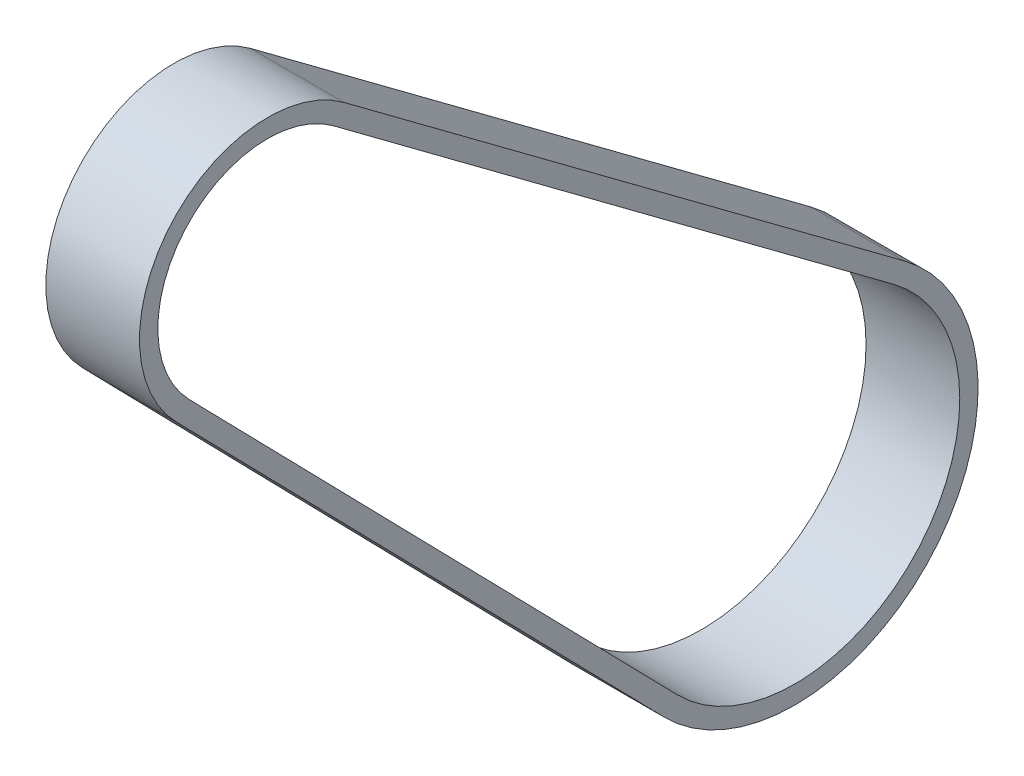
ISO-10303-21;
HEADER;
FILE_DESCRIPTION(('STEP AP214'),'2;1');
FILE_NAME('part.step','',(''),(''),'','','');
FILE_SCHEMA(('AUTOMOTIVE_DESIGN { 1 0 10303 214 1 1 1 1 }'));
ENDSEC;
DATA;
#1=APPLICATION_CONTEXT('core data for automotive mechanical design processes');
#2=APPLICATION_PROTOCOL_DEFINITION('international standard','automotive_design',2000,#1);
#3=PRODUCT_CONTEXT('',#1,'mechanical');
#4=PRODUCT('Part','Part','',(#3));
#5=PRODUCT_RELATED_PRODUCT_CATEGORY('part','',(#4));
#6=PRODUCT_DEFINITION_FORMATION('','',#4);
#7=PRODUCT_DEFINITION_CONTEXT('part definition',#1,'design');
#8=PRODUCT_DEFINITION('design','',#6,#7);
#9=PRODUCT_DEFINITION_SHAPE('','',#8);
#10=(LENGTH_UNIT() NAMED_UNIT(*) SI_UNIT(.MILLI.,.METRE.));
#11=(NAMED_UNIT(*) PLANE_ANGLE_UNIT() SI_UNIT($,.RADIAN.));
#12=(NAMED_UNIT(*) SI_UNIT($,.STERADIAN.) SOLID_ANGLE_UNIT());
#13=UNCERTAINTY_MEASURE_WITH_UNIT(LENGTH_MEASURE(1.E-05),#10,'distance_accuracy_value','');
#14=(GEOMETRIC_REPRESENTATION_CONTEXT(3) GLOBAL_UNCERTAINTY_ASSIGNED_CONTEXT((#13)) GLOBAL_UNIT_ASSIGNED_CONTEXT((#10,
#11,#12)) REPRESENTATION_CONTEXT('',''));
#15=CARTESIAN_POINT('',(0.,0.,0.));
#16=DIRECTION('',(0.,0.,1.));
#17=DIRECTION('',(1.,0.,0.));
#18=AXIS2_PLACEMENT_3D('',#15,#16,#17);
#19=CARTESIAN_POINT('',(22.4539969994646,-67.4140408454674,54.7274415246865));
#20=DIRECTION('',(-1.,0.,0.));
#21=DIRECTION('',(0.,-1.,0.));
#22=AXIS2_PLACEMENT_3D('',#19,#20,#21);
#23=CYLINDRICAL_SURFACE('',#22,7.62);
#24=CARTESIAN_POINT('',(-56.634662924112,-67.4140408454674,54.7274415246865));
#25=DIRECTION('',(-1.,0.,0.));
#26=DIRECTION('',(0.,-1.,0.));
#27=AXIS2_PLACEMENT_3D('',#24,#25,#26);
#28=CIRCLE('',#27,7.62);
#29=CARTESIAN_POINT('',(-56.634662924112,-72.7378708378925,60.1791599887816));
#30=VERTEX_POINT('',#29);
#31=CARTESIAN_POINT('',(-56.634662924112,-61.3034656554542,50.1749399214803));
#32=VERTEX_POINT('',#31);
#33=EDGE_CURVE('E144',#30,#32,#28,.T.);
#34=ORIENTED_EDGE('',*,*,#33,.F.);
#35=DIRECTION('',(-1.,0.,0.));
#36=VECTOR('',#35,1.);
#37=CARTESIAN_POINT('',(22.4539969994646,-72.7378708378925,60.1791599887816));
#38=LINE('',#37,#36);
#39=CARTESIAN_POINT('',(-63.134662924112,-72.7378708378925,60.1791599887816));
#40=VERTEX_POINT('',#39);
#41=EDGE_CURVE('E134',#30,#40,#38,.T.);
#42=ORIENTED_EDGE('',*,*,#41,.T.);
#43=CARTESIAN_POINT('',(-63.134662924112,-67.4140408454674,54.7274415246865));
#44=DIRECTION('',(1.,0.,0.));
#45=DIRECTION('',(0.,0.,-1.));
#46=AXIS2_PLACEMENT_3D('',#43,#44,#45);
#47=CIRCLE('',#46,7.62);
#48=CARTESIAN_POINT('',(-63.134662924112,-61.3034656554542,50.1749399214803));
#49=VERTEX_POINT('',#48);
#50=EDGE_CURVE('E118',#49,#40,#47,.T.);
#51=ORIENTED_EDGE('',*,*,#50,.F.);
#52=DIRECTION('',(-1.,0.,0.));
#53=VECTOR('',#52,1.);
#54=CARTESIAN_POINT('',(22.4539969994646,-61.3034656554542,50.1749399214803));
#55=LINE('',#54,#53);
#56=EDGE_CURVE('E128',#32,#49,#55,.T.);
#57=ORIENTED_EDGE('',*,*,#56,.F.);
#58=EDGE_LOOP('',(#34,#42,#51,#57));
#59=FACE_BOUND('',#58,.T.);
#60=ADVANCED_FACE('F36',(#59),#23,.F.);
#61=CARTESIAN_POINT('',(22.4539969994646,-63.4606529710724,47.279464765196));
#62=DIRECTION('',(0.,0.801912754594918,-0.597441155276392));
#63=DIRECTION('',(0.,0.597441155276392,0.801912754594918));
#64=AXIS2_PLACEMENT_3D('',#61,#62,#63);
#65=PLANE('',#64);
#66=DIRECTION('',(-1.,0.,0.));
#67=VECTOR('',#66,1.);
#68=CARTESIAN_POINT('',(22.4539969994646,-90.2481786545488,11.3240266104861));
#69=LINE('',#68,#67);
#70=CARTESIAN_POINT('',(-56.634662924112,-90.2481786545488,11.3240266104861));
#71=VERTEX_POINT('',#70);
#72=CARTESIAN_POINT('',(-63.134662924112,-90.2481786545488,11.3240266104861));
#73=VERTEX_POINT('',#72);
#74=EDGE_CURVE('E132',#71,#73,#69,.T.);
#75=ORIENTED_EDGE('',*,*,#74,.F.);
#76=DIRECTION('',(0.,0.597441155276392,0.801912754594918));
#77=VECTOR('',#76,1.);
#78=CARTESIAN_POINT('',(-56.634662924112,-63.4606529710724,47.279464765196));
#79=LINE('',#78,#77);
#80=EDGE_CURVE('E131',#71,#32,#79,.T.);
#81=ORIENTED_EDGE('',*,*,#80,.T.);
#82=ORIENTED_EDGE('',*,*,#56,.T.);
#83=DIRECTION('',(0.,-0.597441155276392,-0.801912754594918));
#84=VECTOR('',#83,1.);
#85=CARTESIAN_POINT('',(-63.134662924112,-63.4606529710724,47.279464765196));
#86=LINE('',#85,#84);
#87=EDGE_CURVE('E130',#49,#73,#86,.T.);
#88=ORIENTED_EDGE('',*,*,#87,.T.);
#89=EDGE_LOOP('',(#75,#81,#82,#88));
#90=FACE_BOUND('',#89,.T.);
#91=ADVANCED_FACE('F156',(#90),#65,.F.);
#92=CARTESIAN_POINT('',(22.4539969994646,-99.4140414395687,18.1527790152953));
#93=DIRECTION('',(-1.,0.,0.));
#94=DIRECTION('',(0.,-1.,0.));
#95=AXIS2_PLACEMENT_3D('',#92,#93,#94);
#96=CYLINDRICAL_SURFACE('',#95,11.43);
#97=CARTESIAN_POINT('',(-56.634662924112,-99.4140414395688,18.1527790152953));
#98=DIRECTION('',(-1.,0.,0.));
#99=DIRECTION('',(0.,-1.,0.));
#100=AXIS2_PLACEMENT_3D('',#97,#98,#99);
#101=CIRCLE('',#100,11.43);
#102=CARTESIAN_POINT('',(-56.634662924112,-107.399786428206,26.330356711438));
#103=VERTEX_POINT('',#102);
#104=EDGE_CURVE('E40',#71,#103,#101,.T.);
#105=ORIENTED_EDGE('',*,*,#104,.F.);
#106=ORIENTED_EDGE('',*,*,#74,.T.);
#107=CARTESIAN_POINT('',(-63.134662924112,-99.4140414395688,18.1527790152953));
#108=DIRECTION('',(1.,0.,0.));
#109=DIRECTION('',(0.,0.,-1.));
#110=AXIS2_PLACEMENT_3D('',#107,#108,#109);
#111=CIRCLE('',#110,11.43);
#112=CARTESIAN_POINT('',(-63.134662924112,-107.399786428206,26.330356711438));
#113=VERTEX_POINT('',#112);
#114=EDGE_CURVE('E145',#113,#73,#111,.T.);
#115=ORIENTED_EDGE('',*,*,#114,.F.);
#116=DIRECTION('',(-1.,0.,0.));
#117=VECTOR('',#116,1.);
#118=CARTESIAN_POINT('',(22.4539969994646,-107.399786428206,26.330356711438));
#119=LINE('',#118,#117);
#120=EDGE_CURVE('E119',#103,#113,#119,.T.);
#121=ORIENTED_EDGE('',*,*,#120,.F.);
#122=EDGE_LOOP('',(#105,#106,#115,#121));
#123=FACE_BOUND('',#122,.T.);
#124=ADVANCED_FACE('F192',(#123),#96,.F.);
#125=CARTESIAN_POINT('',(22.4539969994646,-62.4422237727368,46.520714497995));
#126=DIRECTION('',(0.,0.801912754594918,-0.597441155276393));
#127=DIRECTION('',(0.,0.597441155276393,0.801912754594918));
#128=AXIS2_PLACEMENT_3D('',#125,#126,#127);
#129=PLANE('',#128);
#130=DIRECTION('',(0.,0.597441155276393,0.801912754594918));
#131=VECTOR('',#130,1.);
#132=CARTESIAN_POINT('',(-56.634662924112,-62.4422237727369,46.520714497995));
#133=LINE('',#132,#131);
#134=CARTESIAN_POINT('',(-56.634662924112,-89.2297494562133,10.5652763432851));
#135=VERTEX_POINT('',#134);
#136=CARTESIAN_POINT('',(-56.634662924112,-60.2850364571186,49.4161896542793));
#137=VERTEX_POINT('',#136);
#138=EDGE_CURVE('E141',#135,#137,#133,.T.);
#139=ORIENTED_EDGE('',*,*,#138,.F.);
#140=DIRECTION('',(-1.,0.,0.));
#141=VECTOR('',#140,1.);
#142=CARTESIAN_POINT('',(22.4539969994646,-89.2297494562133,10.5652763432851));
#143=LINE('',#142,#141);
#144=CARTESIAN_POINT('',(-63.134662924112,-89.2297494562133,10.5652763432851));
#145=VERTEX_POINT('',#144);
#146=EDGE_CURVE('E116',#135,#145,#143,.T.);
#147=ORIENTED_EDGE('',*,*,#146,.T.);
#148=DIRECTION('',(0.,-0.597441155276393,-0.801912754594918));
#149=VECTOR('',#148,1.);
#150=CARTESIAN_POINT('',(-63.134662924112,-62.4422237727368,46.520714497995));
#151=LINE('',#150,#149);
#152=CARTESIAN_POINT('',(-63.134662924112,-60.2850364571186,49.4161896542793));
#153=VERTEX_POINT('',#152);
#154=EDGE_CURVE('E110',#153,#145,#151,.T.);
#155=ORIENTED_EDGE('',*,*,#154,.F.);
#156=DIRECTION('',(-1.,0.,0.));
#157=VECTOR('',#156,1.);
#158=CARTESIAN_POINT('',(22.4539969994646,-60.2850364571186,49.4161896542793));
#159=LINE('',#158,#157);
#160=EDGE_CURVE('E94',#137,#153,#159,.T.);
#161=ORIENTED_EDGE('',*,*,#160,.F.);
#162=EDGE_LOOP('',(#139,#147,#155,#161));
#163=FACE_BOUND('',#162,.T.);
#164=ADVANCED_FACE('F114',(#163),#129,.T.);
#165=CARTESIAN_POINT('',(22.4539969994646,-67.4140408454674,54.7274415246865));
#166=DIRECTION('',(-1.,0.,0.));
#167=DIRECTION('',(0.,-1.,0.));
#168=AXIS2_PLACEMENT_3D('',#165,#166,#167);
#169=CYLINDRICAL_SURFACE('',#168,8.89);
#170=DIRECTION('',(-1.,0.,0.));
#171=VECTOR('',#170,1.);
#172=CARTESIAN_POINT('',(22.4539969994646,-73.62517583663,61.0877797327974));
#173=LINE('',#172,#171);
#174=CARTESIAN_POINT('',(-56.634662924112,-73.62517583663,61.0877797327975));
#175=VERTEX_POINT('',#174);
#176=CARTESIAN_POINT('',(-63.134662924112,-73.62517583663,61.0877797327974));
#177=VERTEX_POINT('',#176);
#178=EDGE_CURVE('E88',#175,#177,#173,.T.);
#179=ORIENTED_EDGE('',*,*,#178,.F.);
#180=CARTESIAN_POINT('',(-56.634662924112,-67.4140408454674,54.7274415246865));
#181=DIRECTION('',(-1.,0.,0.));
#182=DIRECTION('',(0.,-1.,0.));
#183=AXIS2_PLACEMENT_3D('',#180,#181,#182);
#184=CIRCLE('',#183,8.89);
#185=EDGE_CURVE('E100',#175,#137,#184,.T.);
#186=ORIENTED_EDGE('',*,*,#185,.T.);
#187=ORIENTED_EDGE('',*,*,#160,.T.);
#188=CARTESIAN_POINT('',(-63.134662924112,-67.4140408454674,54.7274415246865));
#189=DIRECTION('',(1.,0.,0.));
#190=DIRECTION('',(0.,0.,-1.));
#191=AXIS2_PLACEMENT_3D('',#188,#189,#190);
#192=CIRCLE('',#191,8.89);
#193=EDGE_CURVE('E97',#153,#177,#192,.T.);
#194=ORIENTED_EDGE('',*,*,#193,.T.);
#195=EDGE_LOOP('',(#179,#186,#187,#194));
#196=FACE_BOUND('',#195,.T.);
#197=ADVANCED_FACE('F96',(#196),#169,.T.);
#198=CARTESIAN_POINT('',(22.4539969994646,-66.4741845998509,68.0710203151323));
#199=DIRECTION('',(0.,0.698665353336618,-0.715448617335318));
#200=DIRECTION('',(0.,0.715448617335318,0.698665353336618));
#201=AXIS2_PLACEMENT_3D('',#198,#199,#200);
#202=PLANE('',#201);
#203=DIRECTION('',(-1.,0.,0.));
#204=VECTOR('',#203,1.);
#205=CARTESIAN_POINT('',(22.4539969994646,-108.287091426944,27.2389764554539));
#206=LINE('',#205,#204);
#207=CARTESIAN_POINT('',(-56.6346629241119,-108.287091426944,27.2389764554539));
#208=VERTEX_POINT('',#207);
#209=CARTESIAN_POINT('',(-63.134662924112,-108.287091426944,27.2389764554539));
#210=VERTEX_POINT('',#209);
#211=EDGE_CURVE('E137',#208,#210,#206,.T.);
#212=ORIENTED_EDGE('',*,*,#211,.F.);
#213=DIRECTION('',(0.,0.715448617335318,0.698665353336618));
#214=VECTOR('',#213,1.);
#215=CARTESIAN_POINT('',(-56.634662924112,-66.4741845998509,68.0710203151322));
#216=LINE('',#215,#214);
#217=EDGE_CURVE('E112',#208,#175,#216,.T.);
#218=ORIENTED_EDGE('',*,*,#217,.T.);
#219=ORIENTED_EDGE('',*,*,#178,.T.);
#220=DIRECTION('',(0.,-0.715448617335318,-0.698665353336618));
#221=VECTOR('',#220,1.);
#222=CARTESIAN_POINT('',(-63.134662924112,-66.4741845998509,68.0710203151323));
#223=LINE('',#222,#221);
#224=EDGE_CURVE('E111',#177,#210,#223,.T.);
#225=ORIENTED_EDGE('',*,*,#224,.T.);
#226=EDGE_LOOP('',(#212,#218,#219,#225));
#227=FACE_BOUND('',#226,.T.);
#228=ADVANCED_FACE('F176',(#227),#202,.F.);
#229=CARTESIAN_POINT('',(22.4539969994646,-99.4140414395687,18.1527790152953));
#230=DIRECTION('',(-1.,0.,0.));
#231=DIRECTION('',(0.,-1.,0.));
#232=AXIS2_PLACEMENT_3D('',#229,#230,#231);
#233=CYLINDRICAL_SURFACE('',#232,12.7);
#234=ORIENTED_EDGE('',*,*,#146,.F.);
#235=CARTESIAN_POINT('',(-56.634662924112,-99.4140414395688,18.1527790152953));
#236=DIRECTION('',(-1.,0.,0.));
#237=DIRECTION('',(0.,-1.,0.));
#238=AXIS2_PLACEMENT_3D('',#235,#236,#237);
#239=CIRCLE('',#238,12.7);
#240=EDGE_CURVE('E139',#135,#208,#239,.T.);
#241=ORIENTED_EDGE('',*,*,#240,.T.);
#242=ORIENTED_EDGE('',*,*,#211,.T.);
#243=CARTESIAN_POINT('',(-63.134662924112,-99.4140414395688,18.1527790152953));
#244=DIRECTION('',(1.,0.,0.));
#245=DIRECTION('',(0.,0.,-1.));
#246=AXIS2_PLACEMENT_3D('',#243,#244,#245);
#247=CIRCLE('',#246,12.7);
#248=EDGE_CURVE('E124',#210,#145,#247,.T.);
#249=ORIENTED_EDGE('',*,*,#248,.T.);
#250=EDGE_LOOP('',(#234,#241,#242,#249));
#251=FACE_BOUND('',#250,.T.);
#252=ADVANCED_FACE('F178',(#251),#233,.T.);
#253=CARTESIAN_POINT('',(22.4539969994646,-65.5868796011134,67.1624005711164));
#254=DIRECTION('',(0.,0.698665353336618,-0.715448617335318));
#255=DIRECTION('',(0.,0.715448617335318,0.698665353336618));
#256=AXIS2_PLACEMENT_3D('',#253,#254,#255);
#257=PLANE('',#256);
#258=DIRECTION('',(0.,0.715448617335318,0.698665353336618));
#259=VECTOR('',#258,1.);
#260=CARTESIAN_POINT('',(-56.634662924112,-65.5868796011134,67.1624005711164));
#261=LINE('',#260,#259);
#262=EDGE_CURVE('E11',#103,#30,#261,.T.);
#263=ORIENTED_EDGE('',*,*,#262,.F.);
#264=ORIENTED_EDGE('',*,*,#120,.T.);
#265=DIRECTION('',(0.,-0.715448617335318,-0.698665353336618));
#266=VECTOR('',#265,1.);
#267=CARTESIAN_POINT('',(-63.134662924112,-65.5868796011134,67.1624005711164));
#268=LINE('',#267,#266);
#269=EDGE_CURVE('E122',#40,#113,#268,.T.);
#270=ORIENTED_EDGE('',*,*,#269,.F.);
#271=ORIENTED_EDGE('',*,*,#41,.F.);
#272=EDGE_LOOP('',(#263,#264,#270,#271));
#273=FACE_BOUND('',#272,.T.);
#274=ADVANCED_FACE('F168',(#273),#257,.T.);
#275=CARTESIAN_POINT('',(-63.134662924112,0.,0.));
#276=DIRECTION('',(1.,0.,0.));
#277=DIRECTION('',(0.,0.,-1.));
#278=AXIS2_PLACEMENT_3D('',#275,#276,#277);
#279=PLANE('',#278);
#280=ORIENTED_EDGE('',*,*,#154,.T.);
#281=ORIENTED_EDGE('',*,*,#248,.F.);
#282=ORIENTED_EDGE('',*,*,#224,.F.);
#283=ORIENTED_EDGE('',*,*,#193,.F.);
#284=EDGE_LOOP('',(#280,#281,#282,#283));
#285=FACE_BOUND('',#284,.T.);
#286=ORIENTED_EDGE('',*,*,#50,.T.);
#287=ORIENTED_EDGE('',*,*,#269,.T.);
#288=ORIENTED_EDGE('',*,*,#114,.T.);
#289=ORIENTED_EDGE('',*,*,#87,.F.);
#290=EDGE_LOOP('',(#286,#287,#288,#289));
#291=FACE_BOUND('',#290,.T.);
#292=ADVANCED_FACE('F107',(#285,#291),#279,.F.);
#293=CARTESIAN_POINT('',(-56.634662924112,-84.9040414395688,18.1527790152953));
#294=DIRECTION('',(-1.,0.,0.));
#295=DIRECTION('',(0.,-1.,0.));
#296=AXIS2_PLACEMENT_3D('',#293,#294,#295);
#297=PLANE('',#296);
#298=ORIENTED_EDGE('',*,*,#138,.T.);
#299=ORIENTED_EDGE('',*,*,#185,.F.);
#300=ORIENTED_EDGE('',*,*,#217,.F.);
#301=ORIENTED_EDGE('',*,*,#240,.F.);
#302=EDGE_LOOP('',(#298,#299,#300,#301));
#303=FACE_BOUND('',#302,.T.);
#304=ORIENTED_EDGE('',*,*,#33,.T.);
#305=ORIENTED_EDGE('',*,*,#80,.F.);
#306=ORIENTED_EDGE('',*,*,#104,.T.);
#307=ORIENTED_EDGE('',*,*,#262,.T.);
#308=EDGE_LOOP('',(#304,#305,#306,#307));
#309=FACE_BOUND('',#308,.T.);
#310=ADVANCED_FACE('F38',(#303,#309),#297,.F.);
#311=CLOSED_SHELL('',(#60,#91,#124,#164,#197,#228,#252,#274,#292,#310));
#312=MANIFOLD_SOLID_BREP('B2',#311);
#313=ADVANCED_BREP_SHAPE_REPRESENTATION('',(#18,#312),#14);
#314=SHAPE_DEFINITION_REPRESENTATION(#9,#313);
ENDSEC;
END-ISO-10303-21;
